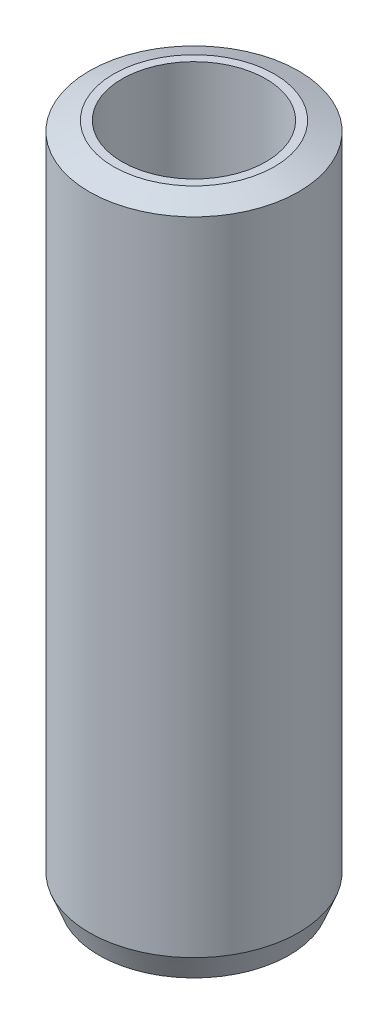
ISO-10303-21;
HEADER;
FILE_DESCRIPTION(('STEP AP214'),'2;1');
FILE_NAME('part.step','',(''),(''),'','','');
FILE_SCHEMA(('AUTOMOTIVE_DESIGN { 1 0 10303 214 1 1 1 1 }'));
ENDSEC;
DATA;
#1=APPLICATION_CONTEXT('core data for automotive mechanical design processes');
#2=APPLICATION_PROTOCOL_DEFINITION('international standard','automotive_design',2000,#1);
#3=PRODUCT_CONTEXT('',#1,'mechanical');
#4=PRODUCT('Part','Part','',(#3));
#5=PRODUCT_RELATED_PRODUCT_CATEGORY('part','',(#4));
#6=PRODUCT_DEFINITION_FORMATION('','',#4);
#7=PRODUCT_DEFINITION_CONTEXT('part definition',#1,'design');
#8=PRODUCT_DEFINITION('design','',#6,#7);
#9=PRODUCT_DEFINITION_SHAPE('','',#8);
#10=(LENGTH_UNIT() NAMED_UNIT(*) SI_UNIT(.MILLI.,.METRE.));
#11=(NAMED_UNIT(*) PLANE_ANGLE_UNIT() SI_UNIT($,.RADIAN.));
#12=(NAMED_UNIT(*) SI_UNIT($,.STERADIAN.) SOLID_ANGLE_UNIT());
#13=UNCERTAINTY_MEASURE_WITH_UNIT(LENGTH_MEASURE(1.E-05),#10,'distance_accuracy_value','');
#14=(GEOMETRIC_REPRESENTATION_CONTEXT(3) GLOBAL_UNCERTAINTY_ASSIGNED_CONTEXT((#13)) GLOBAL_UNIT_ASSIGNED_CONTEXT((#10,
#11,#12)) REPRESENTATION_CONTEXT('',''));
#15=CARTESIAN_POINT('',(0.,0.,0.));
#16=DIRECTION('',(0.,0.,1.));
#17=DIRECTION('',(1.,0.,0.));
#18=AXIS2_PLACEMENT_3D('',#15,#16,#17);
#19=CARTESIAN_POINT('',(0.,290.30218747537,0.));
#20=DIRECTION('',(0.,-1.,0.));
#21=DIRECTION('',(0.,0.,-1.));
#22=AXIS2_PLACEMENT_3D('',#19,#20,#21);
#23=CYLINDRICAL_SURFACE('',#22,45.);
#24=CARTESIAN_POINT('',(0.,286.195103069627,0.));
#25=DIRECTION('',(0.,1.,0.));
#26=DIRECTION('',(0.,0.,1.));
#27=AXIS2_PLACEMENT_3D('',#24,#25,#26);
#28=CIRCLE('',#27,45.);
#29=CARTESIAN_POINT('',(0.,286.195103069627,45.));
#30=VERTEX_POINT('',#29);
#31=EDGE_CURVE('E50',#30,#30,#28,.F.);
#32=ORIENTED_EDGE('',*,*,#31,.T.);
#33=EDGE_LOOP('',(#32));
#34=FACE_BOUND('',#33,.T.);
#35=CARTESIAN_POINT('',(0.,10.454261867084,0.));
#36=DIRECTION('',(0.,1.,0.));
#37=DIRECTION('',(0.,0.,1.));
#38=AXIS2_PLACEMENT_3D('',#35,#36,#37);
#39=CIRCLE('',#38,45.);
#40=CARTESIAN_POINT('',(0.,10.454261867084,45.));
#41=VERTEX_POINT('',#40);
#42=EDGE_CURVE('E51',#41,#41,#39,.T.);
#43=ORIENTED_EDGE('',*,*,#42,.T.);
#44=EDGE_LOOP('',(#43));
#45=FACE_BOUND('',#44,.T.);
#46=ADVANCED_FACE('F39',(#34,#45),#23,.T.);
#47=CARTESIAN_POINT('',(0.,290.30218747537,0.));
#48=DIRECTION('',(0.,1.,0.));
#49=DIRECTION('',(0.,0.,1.));
#50=AXIS2_PLACEMENT_3D('',#47,#48,#49);
#51=PLANE('',#50);
#52=CARTESIAN_POINT('',(0.,290.30218747537,0.));
#53=DIRECTION('',(0.,1.,0.));
#54=DIRECTION('',(0.,0.,1.));
#55=AXIS2_PLACEMENT_3D('',#52,#53,#54);
#56=CIRCLE('',#55,34.5457381329158);
#57=CARTESIAN_POINT('',(0.,290.30218747537,34.5457381329158));
#58=VERTEX_POINT('',#57);
#59=EDGE_CURVE('E54',#58,#58,#56,.T.);
#60=ORIENTED_EDGE('',*,*,#59,.T.);
#61=EDGE_LOOP('',(#60));
#62=FACE_BOUND('',#61,.T.);
#63=CARTESIAN_POINT('',(0.,290.30218747537,0.));
#64=DIRECTION('',(0.,1.,0.));
#65=DIRECTION('',(0.,0.,1.));
#66=AXIS2_PLACEMENT_3D('',#63,#64,#65);
#67=CIRCLE('',#66,30.902431236927);
#68=CARTESIAN_POINT('',(0.,290.30218747537,30.902431236927));
#69=VERTEX_POINT('',#68);
#70=EDGE_CURVE('E58',#69,#69,#67,.T.);
#71=ORIENTED_EDGE('',*,*,#70,.F.);
#72=EDGE_LOOP('',(#71));
#73=FACE_BOUND('',#72,.T.);
#74=ADVANCED_FACE('F69',(#62,#73),#51,.T.);
#75=CARTESIAN_POINT('',(0.,0.,0.));
#76=DIRECTION('',(0.,1.,0.));
#77=DIRECTION('',(0.,0.,1.));
#78=AXIS2_PLACEMENT_3D('',#75,#76,#77);
#79=PLANE('',#78);
#80=CARTESIAN_POINT('',(0.,0.,0.));
#81=DIRECTION('',(0.,1.,0.));
#82=DIRECTION('',(0.,0.,1.));
#83=AXIS2_PLACEMENT_3D('',#80,#81,#82);
#84=CIRCLE('',#83,40.8929155942563);
#85=CARTESIAN_POINT('',(0.,0.,40.8929155942563));
#86=VERTEX_POINT('',#85);
#87=EDGE_CURVE('E10',#86,#86,#84,.F.);
#88=ORIENTED_EDGE('',*,*,#87,.T.);
#89=EDGE_LOOP('',(#88));
#90=FACE_BOUND('',#89,.T.);
#91=CARTESIAN_POINT('',(0.,0.,0.));
#92=DIRECTION('',(0.,1.,0.));
#93=DIRECTION('',(0.,0.,1.));
#94=AXIS2_PLACEMENT_3D('',#91,#92,#93);
#95=CIRCLE('',#94,30.902431236927);
#96=CARTESIAN_POINT('',(0.,0.,30.902431236927));
#97=VERTEX_POINT('',#96);
#98=EDGE_CURVE('E63',#97,#97,#95,.T.);
#99=ORIENTED_EDGE('',*,*,#98,.T.);
#100=EDGE_LOOP('',(#99));
#101=FACE_BOUND('',#100,.T.);
#102=ADVANCED_FACE('F75',(#90,#101),#79,.F.);
#103=CARTESIAN_POINT('',(0.,290.30218747537,0.));
#104=DIRECTION('',(0.,-1.,0.));
#105=DIRECTION('',(0.,0.,-1.));
#106=AXIS2_PLACEMENT_3D('',#103,#104,#105);
#107=CYLINDRICAL_SURFACE('',#106,30.902431236927);
#108=ORIENTED_EDGE('',*,*,#70,.T.);
#109=EDGE_LOOP('',(#108));
#110=FACE_BOUND('',#109,.T.);
#111=ORIENTED_EDGE('',*,*,#98,.F.);
#112=EDGE_LOOP('',(#111));
#113=FACE_BOUND('',#112,.T.);
#114=ADVANCED_FACE('F70',(#110,#113),#107,.F.);
#115=CARTESIAN_POINT('',(0.,290.30218747537,0.));
#116=DIRECTION('',(0.,-1.,0.));
#117=DIRECTION('',(0.,0.,-1.));
#118=AXIS2_PLACEMENT_3D('',#115,#116,#117);
#119=CONICAL_SURFACE('',#118,34.5457381329158,1.19645832240341);
#120=ORIENTED_EDGE('',*,*,#31,.F.);
#121=EDGE_LOOP('',(#120));
#122=FACE_BOUND('',#121,.T.);
#123=ORIENTED_EDGE('',*,*,#59,.F.);
#124=EDGE_LOOP('',(#123));
#125=FACE_BOUND('',#124,.T.);
#126=ADVANCED_FACE('F81',(#122,#125),#119,.T.);
#127=CARTESIAN_POINT('',(0.,10.454261867084,0.));
#128=DIRECTION('',(0.,1.,0.));
#129=DIRECTION('',(0.,0.,1.));
#130=AXIS2_PLACEMENT_3D('',#127,#128,#129);
#131=CONICAL_SURFACE('',#130,45.,0.374338004391484);
#132=ORIENTED_EDGE('',*,*,#87,.F.);
#133=EDGE_LOOP('',(#132));
#134=FACE_BOUND('',#133,.T.);
#135=ORIENTED_EDGE('',*,*,#42,.F.);
#136=EDGE_LOOP('',(#135));
#137=FACE_BOUND('',#136,.T.);
#138=ADVANCED_FACE('F45',(#134,#137),#131,.T.);
#139=CLOSED_SHELL('',(#46,#74,#102,#114,#126,#138));
#140=MANIFOLD_SOLID_BREP('B2',#139);
#141=ADVANCED_BREP_SHAPE_REPRESENTATION('',(#18,#140),#14);
#142=SHAPE_DEFINITION_REPRESENTATION(#9,#141);
ENDSEC;
END-ISO-10303-21;
